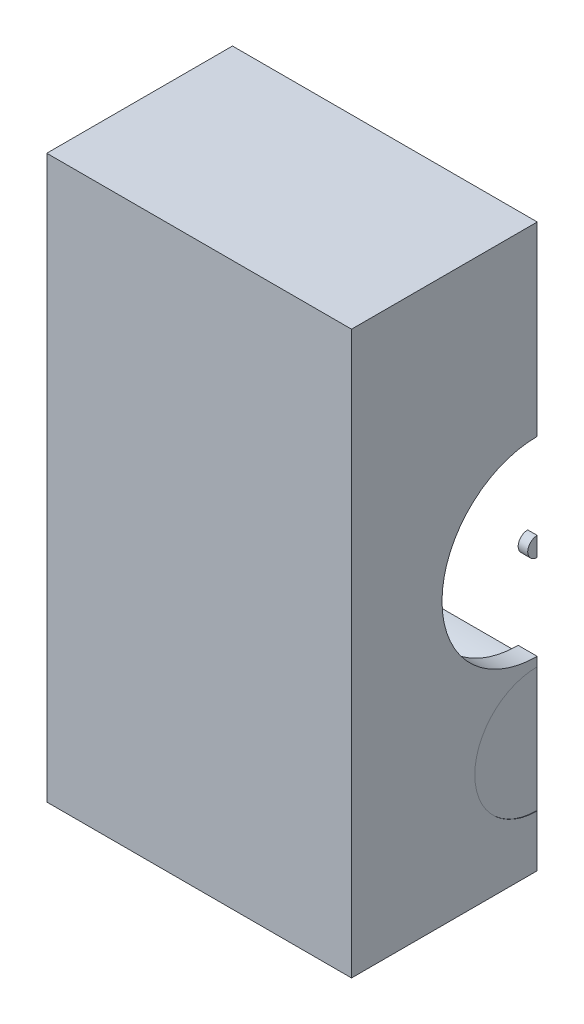
ISO-10303-21;
HEADER;
FILE_DESCRIPTION(('STEP AP214'),'2;1');
FILE_NAME('part.step','',(''),(''),'','','');
FILE_SCHEMA(('AUTOMOTIVE_DESIGN { 1 0 10303 214 1 1 1 1 }'));
ENDSEC;
DATA;
#1=APPLICATION_CONTEXT('core data for automotive mechanical design processes');
#2=APPLICATION_PROTOCOL_DEFINITION('international standard','automotive_design',2000,#1);
#3=PRODUCT_CONTEXT('',#1,'mechanical');
#4=PRODUCT('Part','Part','',(#3));
#5=PRODUCT_RELATED_PRODUCT_CATEGORY('part','',(#4));
#6=PRODUCT_DEFINITION_FORMATION('','',#4);
#7=PRODUCT_DEFINITION_CONTEXT('part definition',#1,'design');
#8=PRODUCT_DEFINITION('design','',#6,#7);
#9=PRODUCT_DEFINITION_SHAPE('','',#8);
#10=(LENGTH_UNIT() NAMED_UNIT(*) SI_UNIT(.MILLI.,.METRE.));
#11=(NAMED_UNIT(*) PLANE_ANGLE_UNIT() SI_UNIT($,.RADIAN.));
#12=(NAMED_UNIT(*) SI_UNIT($,.STERADIAN.) SOLID_ANGLE_UNIT());
#13=UNCERTAINTY_MEASURE_WITH_UNIT(LENGTH_MEASURE(1.E-05),#10,'distance_accuracy_value','');
#14=(GEOMETRIC_REPRESENTATION_CONTEXT(3) GLOBAL_UNCERTAINTY_ASSIGNED_CONTEXT((#13)) GLOBAL_UNIT_ASSIGNED_CONTEXT((#10,
#11,#12)) REPRESENTATION_CONTEXT('',''));
#15=CARTESIAN_POINT('',(0.,0.,0.));
#16=DIRECTION('',(0.,0.,1.));
#17=DIRECTION('',(1.,0.,0.));
#18=AXIS2_PLACEMENT_3D('',#15,#16,#17);
#19=CARTESIAN_POINT('',(290.,275.,195.));
#20=DIRECTION('',(1.,0.,0.));
#21=DIRECTION('',(0.,0.,-1.));
#22=AXIS2_PLACEMENT_3D('',#19,#20,#21);
#23=CYLINDRICAL_SURFACE('',#22,10.);
#24=DIRECTION('',(1.,0.,0.));
#25=VECTOR('',#24,1.);
#26=CARTESIAN_POINT('',(290.,265.,195.));
#27=LINE('',#26,#25);
#28=CARTESIAN_POINT('',(300.,265.,195.));
#29=VERTEX_POINT('',#28);
#30=CARTESIAN_POINT('',(290.,265.,195.));
#31=VERTEX_POINT('',#30);
#32=EDGE_CURVE('E61',#29,#31,#27,.F.);
#33=ORIENTED_EDGE('',*,*,#32,.F.);
#34=CARTESIAN_POINT('',(300.,275.,195.));
#35=DIRECTION('',(1.,0.,0.));
#36=DIRECTION('',(0.,0.,-1.));
#37=AXIS2_PLACEMENT_3D('',#34,#35,#36);
#38=CIRCLE('',#37,10.);
#39=CARTESIAN_POINT('',(300.,285.,195.));
#40=VERTEX_POINT('',#39);
#41=EDGE_CURVE('E72',#40,#29,#38,.T.);
#42=ORIENTED_EDGE('',*,*,#41,.F.);
#43=DIRECTION('',(1.,0.,0.));
#44=VECTOR('',#43,1.);
#45=CARTESIAN_POINT('',(290.,285.,195.));
#46=LINE('',#45,#44);
#47=CARTESIAN_POINT('',(290.,285.,195.));
#48=VERTEX_POINT('',#47);
#49=EDGE_CURVE('E56',#48,#40,#46,.T.);
#50=ORIENTED_EDGE('',*,*,#49,.F.);
#51=CARTESIAN_POINT('',(290.,275.,195.));
#52=DIRECTION('',(1.,0.,0.));
#53=DIRECTION('',(0.,0.,-1.));
#54=AXIS2_PLACEMENT_3D('',#51,#52,#53);
#55=CIRCLE('',#54,10.);
#56=EDGE_CURVE('E50',#48,#31,#55,.T.);
#57=ORIENTED_EDGE('',*,*,#56,.T.);
#58=EDGE_LOOP('',(#33,#42,#50,#57));
#59=FACE_BOUND('',#58,.T.);
#60=ADVANCED_FACE('F43',(#59),#23,.T.);
#61=CARTESIAN_POINT('',(290.,275.,195.));
#62=DIRECTION('',(1.,0.,0.));
#63=DIRECTION('',(0.,0.,-1.));
#64=AXIS2_PLACEMENT_3D('',#61,#62,#63);
#65=PLANE('',#64);
#66=ORIENTED_EDGE('',*,*,#56,.F.);
#67=DIRECTION('',(0.,-1.,0.));
#68=VECTOR('',#67,1.);
#69=CARTESIAN_POINT('',(290.,275.,195.));
#70=LINE('',#69,#68);
#71=EDGE_CURVE('E79',#48,#31,#70,.T.);
#72=ORIENTED_EDGE('',*,*,#71,.T.);
#73=EDGE_LOOP('',(#66,#72));
#74=FACE_BOUND('',#73,.T.);
#75=ADVANCED_FACE('F81',(#74),#65,.F.);
#76=CARTESIAN_POINT('',(300.,275.,195.));
#77=DIRECTION('',(1.,0.,0.));
#78=DIRECTION('',(0.,0.,-1.));
#79=AXIS2_PLACEMENT_3D('',#76,#77,#78);
#80=PLANE('',#79);
#81=DIRECTION('',(0.,-1.,0.));
#82=VECTOR('',#81,1.);
#83=CARTESIAN_POINT('',(300.,275.,195.));
#84=LINE('',#83,#82);
#85=EDGE_CURVE('E12',#40,#29,#84,.T.);
#86=ORIENTED_EDGE('',*,*,#85,.F.);
#87=ORIENTED_EDGE('',*,*,#41,.T.);
#88=EDGE_LOOP('',(#86,#87));
#89=FACE_BOUND('',#88,.T.);
#90=ADVANCED_FACE('F75',(#89),#80,.T.);
#91=CARTESIAN_POINT('',(-20.,570.,195.));
#92=DIRECTION('',(0.,0.,1.));
#93=DIRECTION('',(1.,0.,0.));
#94=AXIS2_PLACEMENT_3D('',#91,#92,#93);
#95=PLANE('',#94);
#96=ORIENTED_EDGE('',*,*,#32,.T.);
#97=ORIENTED_EDGE('',*,*,#71,.F.);
#98=ORIENTED_EDGE('',*,*,#49,.T.);
#99=ORIENTED_EDGE('',*,*,#85,.T.);
#100=EDGE_LOOP('',(#96,#97,#98,#99));
#101=FACE_BOUND('',#100,.T.);
#102=ADVANCED_FACE('F66',(#101),#95,.F.);
#103=CLOSED_SHELL('',(#60,#75,#90,#102));
#104=MANIFOLD_SOLID_BREP('B2',#103);
#105=CARTESIAN_POINT('',(141.5,100.,195.));
#106=DIRECTION('',(-1.,0.,0.));
#107=DIRECTION('',(0.,0.,1.));
#108=AXIS2_PLACEMENT_3D('',#105,#106,#107);
#109=PLANE('',#108);
#110=CARTESIAN_POINT('',(141.5,100.,195.));
#111=DIRECTION('',(-1.,0.,0.));
#112=DIRECTION('',(0.,0.,1.));
#113=AXIS2_PLACEMENT_3D('',#110,#111,#112);
#114=CIRCLE('',#113,65.55);
#115=CARTESIAN_POINT('',(141.5,165.55,195.));
#116=VERTEX_POINT('',#115);
#117=CARTESIAN_POINT('',(141.5,34.45,195.));
#118=VERTEX_POINT('',#117);
#119=EDGE_CURVE('E267',#116,#118,#114,.F.);
#120=ORIENTED_EDGE('',*,*,#119,.T.);
#121=DIRECTION('',(0.,1.,0.));
#122=VECTOR('',#121,1.);
#123=CARTESIAN_POINT('',(141.5,100.,195.));
#124=LINE('',#123,#122);
#125=EDGE_CURVE('E281',#118,#116,#124,.T.);
#126=ORIENTED_EDGE('',*,*,#125,.T.);
#127=EDGE_LOOP('',(#120,#126));
#128=FACE_BOUND('',#127,.T.);
#129=ADVANCED_FACE('F115',(#128),#109,.F.);
#130=CARTESIAN_POINT('',(298.5,100.,195.));
#131=DIRECTION('',(1.,0.,0.));
#132=DIRECTION('',(0.,0.,-1.));
#133=AXIS2_PLACEMENT_3D('',#130,#131,#132);
#134=PLANE('',#133);
#135=CARTESIAN_POINT('',(298.5,100.,195.));
#136=DIRECTION('',(1.,0.,0.));
#137=DIRECTION('',(0.,0.,-1.));
#138=AXIS2_PLACEMENT_3D('',#135,#136,#137);
#139=CIRCLE('',#138,65.55);
#140=CARTESIAN_POINT('',(298.5,34.45,195.));
#141=VERTEX_POINT('',#140);
#142=CARTESIAN_POINT('',(298.5,165.55,195.));
#143=VERTEX_POINT('',#142);
#144=EDGE_CURVE('E263',#141,#143,#139,.F.);
#145=ORIENTED_EDGE('',*,*,#144,.T.);
#146=DIRECTION('',(0.,-1.,0.));
#147=VECTOR('',#146,1.);
#148=CARTESIAN_POINT('',(298.5,100.,195.));
#149=LINE('',#148,#147);
#150=EDGE_CURVE('E138',#143,#141,#149,.T.);
#151=ORIENTED_EDGE('',*,*,#150,.T.);
#152=EDGE_LOOP('',(#145,#151));
#153=FACE_BOUND('',#152,.T.);
#154=ADVANCED_FACE('F280',(#153),#134,.F.);
#155=CARTESIAN_POINT('',(280.,100.,195.));
#156=DIRECTION('',(1.,0.,0.));
#157=DIRECTION('',(0.,0.,-1.));
#158=AXIS2_PLACEMENT_3D('',#155,#156,#157);
#159=CYLINDRICAL_SURFACE('',#158,65.55);
#160=ORIENTED_EDGE('',*,*,#144,.F.);
#161=DIRECTION('',(1.,0.,0.));
#162=VECTOR('',#161,1.);
#163=CARTESIAN_POINT('',(280.,34.45,195.));
#164=LINE('',#163,#162);
#165=EDGE_CURVE('E41',#141,#118,#164,.F.);
#166=ORIENTED_EDGE('',*,*,#165,.T.);
#167=ORIENTED_EDGE('',*,*,#119,.F.);
#168=DIRECTION('',(1.,0.,0.));
#169=VECTOR('',#168,1.);
#170=CARTESIAN_POINT('',(280.,165.55,195.));
#171=LINE('',#170,#169);
#172=EDGE_CURVE('E123',#116,#143,#171,.T.);
#173=ORIENTED_EDGE('',*,*,#172,.T.);
#174=EDGE_LOOP('',(#160,#166,#167,#173));
#175=FACE_BOUND('',#174,.T.);
#176=ADVANCED_FACE('F277',(#175),#159,.F.);
#177=CARTESIAN_POINT('',(-20.,570.,195.));
#178=DIRECTION('',(0.,0.,1.));
#179=DIRECTION('',(1.,0.,0.));
#180=AXIS2_PLACEMENT_3D('',#177,#178,#179);
#181=PLANE('',#180);
#182=ORIENTED_EDGE('',*,*,#150,.F.);
#183=ORIENTED_EDGE('',*,*,#172,.F.);
#184=ORIENTED_EDGE('',*,*,#125,.F.);
#185=ORIENTED_EDGE('',*,*,#165,.F.);
#186=EDGE_LOOP('',(#182,#183,#184,#185));
#187=FACE_BOUND('',#186,.T.);
#188=DIRECTION('',(0.,-1.,0.));
#189=VECTOR('',#188,1.);
#190=CARTESIAN_POINT('',(300.,570.,195.));
#191=LINE('',#190,#189);
#192=CARTESIAN_POINT('',(300.,34.45,195.));
#193=VERTEX_POINT('',#192);
#194=CARTESIAN_POINT('',(300.,-20.,195.));
#195=VERTEX_POINT('',#194);
#196=EDGE_CURVE('E244',#193,#195,#191,.T.);
#197=ORIENTED_EDGE('',*,*,#196,.T.);
#198=DIRECTION('',(1.,0.,0.));
#199=VECTOR('',#198,1.);
#200=CARTESIAN_POINT('',(-20.,-20.,195.));
#201=LINE('',#200,#199);
#202=CARTESIAN_POINT('',(-20.,-20.,195.));
#203=VERTEX_POINT('',#202);
#204=EDGE_CURVE('E238',#203,#195,#201,.T.);
#205=ORIENTED_EDGE('',*,*,#204,.F.);
#206=DIRECTION('',(0.,-1.,0.));
#207=VECTOR('',#206,1.);
#208=CARTESIAN_POINT('',(-20.,570.,195.));
#209=LINE('',#208,#207);
#210=CARTESIAN_POINT('',(-20.,570.,195.));
#211=VERTEX_POINT('',#210);
#212=EDGE_CURVE('E241',#211,#203,#209,.T.);
#213=ORIENTED_EDGE('',*,*,#212,.F.);
#214=DIRECTION('',(1.,0.,0.));
#215=VECTOR('',#214,1.);
#216=CARTESIAN_POINT('',(-20.,570.,195.));
#217=LINE('',#216,#215);
#218=CARTESIAN_POINT('',(300.,570.,195.));
#219=VERTEX_POINT('',#218);
#220=EDGE_CURVE('E249',#211,#219,#217,.T.);
#221=ORIENTED_EDGE('',*,*,#220,.T.);
#222=CARTESIAN_POINT('',(300.,375.,195.));
#223=VERTEX_POINT('',#222);
#224=EDGE_CURVE('E258',#219,#223,#191,.T.);
#225=ORIENTED_EDGE('',*,*,#224,.T.);
#226=DIRECTION('',(1.,0.,0.));
#227=VECTOR('',#226,1.);
#228=CARTESIAN_POINT('',(280.,375.,195.));
#229=LINE('',#228,#227);
#230=CARTESIAN_POINT('',(280.,375.,195.));
#231=VERTEX_POINT('',#230);
#232=EDGE_CURVE('E314',#231,#223,#229,.T.);
#233=ORIENTED_EDGE('',*,*,#232,.F.);
#234=DIRECTION('',(0.,1.,0.));
#235=VECTOR('',#234,1.);
#236=CARTESIAN_POINT('',(280.,0.,195.));
#237=LINE('',#236,#235);
#238=CARTESIAN_POINT('',(280.,550.,195.));
#239=VERTEX_POINT('',#238);
#240=EDGE_CURVE('E304',#231,#239,#237,.T.);
#241=ORIENTED_EDGE('',*,*,#240,.T.);
#242=DIRECTION('',(-1.,0.,0.));
#243=VECTOR('',#242,1.);
#244=CARTESIAN_POINT('',(0.,550.,195.));
#245=LINE('',#244,#243);
#246=CARTESIAN_POINT('',(0.,550.,195.));
#247=VERTEX_POINT('',#246);
#248=EDGE_CURVE('E312',#239,#247,#245,.T.);
#249=ORIENTED_EDGE('',*,*,#248,.T.);
#250=DIRECTION('',(0.,-1.,0.));
#251=VECTOR('',#250,1.);
#252=CARTESIAN_POINT('',(0.,0.,195.));
#253=LINE('',#252,#251);
#254=CARTESIAN_POINT('',(0.,0.,195.));
#255=VERTEX_POINT('',#254);
#256=EDGE_CURVE('E310',#247,#255,#253,.T.);
#257=ORIENTED_EDGE('',*,*,#256,.T.);
#258=DIRECTION('',(1.,0.,0.));
#259=VECTOR('',#258,1.);
#260=CARTESIAN_POINT('',(0.,0.,195.));
#261=LINE('',#260,#259);
#262=CARTESIAN_POINT('',(280.,0.,195.));
#263=VERTEX_POINT('',#262);
#264=EDGE_CURVE('E305',#255,#263,#261,.T.);
#265=ORIENTED_EDGE('',*,*,#264,.T.);
#266=CARTESIAN_POINT('',(280.,31.45,195.));
#267=VERTEX_POINT('',#266);
#268=EDGE_CURVE('E303',#263,#267,#237,.T.);
#269=ORIENTED_EDGE('',*,*,#268,.T.);
#270=DIRECTION('',(1.,0.,0.));
#271=VECTOR('',#270,1.);
#272=CARTESIAN_POINT('',(140.,31.45,195.));
#273=LINE('',#272,#271);
#274=CARTESIAN_POINT('',(140.,31.45,195.));
#275=VERTEX_POINT('',#274);
#276=EDGE_CURVE('E298',#275,#267,#273,.T.);
#277=ORIENTED_EDGE('',*,*,#276,.F.);
#278=DIRECTION('',(0.,1.,0.));
#279=VECTOR('',#278,1.);
#280=CARTESIAN_POINT('',(140.,100.,195.));
#281=LINE('',#280,#279);
#282=CARTESIAN_POINT('',(140.,34.45,195.));
#283=VERTEX_POINT('',#282);
#284=EDGE_CURVE('E294',#275,#283,#281,.T.);
#285=ORIENTED_EDGE('',*,*,#284,.T.);
#286=DIRECTION('',(1.,0.,0.));
#287=VECTOR('',#286,1.);
#288=CARTESIAN_POINT('',(280.,34.45,195.));
#289=LINE('',#288,#287);
#290=CARTESIAN_POINT('',(140.5,34.45,195.));
#291=VERTEX_POINT('',#290);
#292=EDGE_CURVE('E130',#291,#283,#289,.F.);
#293=ORIENTED_EDGE('',*,*,#292,.F.);
#294=DIRECTION('',(0.,1.,0.));
#295=VECTOR('',#294,1.);
#296=CARTESIAN_POINT('',(140.5,100.,195.));
#297=LINE('',#296,#295);
#298=CARTESIAN_POINT('',(140.5,165.55,195.));
#299=VERTEX_POINT('',#298);
#300=EDGE_CURVE('E283',#291,#299,#297,.T.);
#301=ORIENTED_EDGE('',*,*,#300,.T.);
#302=DIRECTION('',(1.,0.,0.));
#303=VECTOR('',#302,1.);
#304=CARTESIAN_POINT('',(280.,165.55,195.));
#305=LINE('',#304,#303);
#306=CARTESIAN_POINT('',(140.,165.55,195.));
#307=VERTEX_POINT('',#306);
#308=EDGE_CURVE('E288',#307,#299,#305,.T.);
#309=ORIENTED_EDGE('',*,*,#308,.F.);
#310=CARTESIAN_POINT('',(140.,168.55,195.));
#311=VERTEX_POINT('',#310);
#312=EDGE_CURVE('E292',#307,#311,#281,.T.);
#313=ORIENTED_EDGE('',*,*,#312,.T.);
#314=DIRECTION('',(1.,0.,0.));
#315=VECTOR('',#314,1.);
#316=CARTESIAN_POINT('',(140.,168.55,195.));
#317=LINE('',#316,#315);
#318=CARTESIAN_POINT('',(280.,168.55,195.));
#319=VERTEX_POINT('',#318);
#320=EDGE_CURVE('E295',#319,#311,#317,.F.);
#321=ORIENTED_EDGE('',*,*,#320,.F.);
#322=CARTESIAN_POINT('',(280.,175.,195.));
#323=VERTEX_POINT('',#322);
#324=EDGE_CURVE('E301',#319,#323,#237,.T.);
#325=ORIENTED_EDGE('',*,*,#324,.T.);
#326=DIRECTION('',(1.,0.,0.));
#327=VECTOR('',#326,1.);
#328=CARTESIAN_POINT('',(280.,175.,195.));
#329=LINE('',#328,#327);
#330=CARTESIAN_POINT('',(300.,175.,195.));
#331=VERTEX_POINT('',#330);
#332=EDGE_CURVE('E307',#331,#323,#329,.F.);
#333=ORIENTED_EDGE('',*,*,#332,.F.);
#334=CARTESIAN_POINT('',(300.,165.55,195.));
#335=VERTEX_POINT('',#334);
#336=EDGE_CURVE('E391',#331,#335,#191,.T.);
#337=ORIENTED_EDGE('',*,*,#336,.T.);
#338=DIRECTION('',(1.,0.,0.));
#339=VECTOR('',#338,1.);
#340=CARTESIAN_POINT('',(280.,165.55,195.));
#341=LINE('',#340,#339);
#342=CARTESIAN_POINT('',(299.5,165.55,195.));
#343=VERTEX_POINT('',#342);
#344=EDGE_CURVE('E319',#343,#335,#341,.T.);
#345=ORIENTED_EDGE('',*,*,#344,.F.);
#346=DIRECTION('',(0.,-1.,0.));
#347=VECTOR('',#346,1.);
#348=CARTESIAN_POINT('',(299.5,100.,195.));
#349=LINE('',#348,#347);
#350=CARTESIAN_POINT('',(299.5,34.45,195.));
#351=VERTEX_POINT('',#350);
#352=EDGE_CURVE('E317',#343,#351,#349,.T.);
#353=ORIENTED_EDGE('',*,*,#352,.T.);
#354=DIRECTION('',(1.,0.,0.));
#355=VECTOR('',#354,1.);
#356=CARTESIAN_POINT('',(280.,34.45,195.));
#357=LINE('',#356,#355);
#358=EDGE_CURVE('E322',#193,#351,#357,.F.);
#359=ORIENTED_EDGE('',*,*,#358,.F.);
#360=EDGE_LOOP('',(#197,#205,#213,#221,#225,#233,#241,#249,#257,#265,#269,#277,#285,#293,#301,
#309,#313,#321,#325,#333,#337,#345,#353,#359));
#361=FACE_BOUND('',#360,.T.);
#362=ADVANCED_FACE('F240',(#187,#361),#181,.F.);
#363=CARTESIAN_POINT('',(140.5,100.,195.));
#364=DIRECTION('',(-1.,0.,0.));
#365=DIRECTION('',(0.,0.,1.));
#366=AXIS2_PLACEMENT_3D('',#363,#364,#365);
#367=CIRCLE('',#366,65.55);
#368=EDGE_CURVE('E325',#291,#299,#367,.T.);
#369=ORIENTED_EDGE('',*,*,#368,.F.);
#370=ORIENTED_EDGE('',*,*,#292,.T.);
#371=CARTESIAN_POINT('',(140.,100.,195.));
#372=DIRECTION('',(-1.,0.,0.));
#373=DIRECTION('',(0.,0.,1.));
#374=AXIS2_PLACEMENT_3D('',#371,#372,#373);
#375=CIRCLE('',#374,65.55);
#376=EDGE_CURVE('E331',#283,#307,#375,.T.);
#377=ORIENTED_EDGE('',*,*,#376,.T.);
#378=ORIENTED_EDGE('',*,*,#308,.T.);
#379=EDGE_LOOP('',(#369,#370,#377,#378));
#380=FACE_BOUND('',#379,.T.);
#381=ADVANCED_FACE('F423',(#380),#159,.F.);
#382=CARTESIAN_POINT('',(280.,0.,390.));
#383=DIRECTION('',(-1.,0.,0.));
#384=DIRECTION('',(0.,0.,1.));
#385=AXIS2_PLACEMENT_3D('',#382,#383,#384);
#386=PLANE('',#385);
#387=ORIENTED_EDGE('',*,*,#268,.F.);
#388=DIRECTION('',(0.,0.,-1.));
#389=VECTOR('',#388,1.);
#390=CARTESIAN_POINT('',(280.,0.,390.));
#391=LINE('',#390,#389);
#392=CARTESIAN_POINT('',(280.,0.,370.));
#393=VERTEX_POINT('',#392);
#394=EDGE_CURVE('E367',#393,#263,#391,.T.);
#395=ORIENTED_EDGE('',*,*,#394,.F.);
#396=DIRECTION('',(0.,1.,0.));
#397=VECTOR('',#396,1.);
#398=CARTESIAN_POINT('',(280.,550.,370.));
#399=LINE('',#398,#397);
#400=CARTESIAN_POINT('',(280.,550.,370.));
#401=VERTEX_POINT('',#400);
#402=EDGE_CURVE('E355',#393,#401,#399,.T.);
#403=ORIENTED_EDGE('',*,*,#402,.T.);
#404=DIRECTION('',(0.,0.,-1.));
#405=VECTOR('',#404,1.);
#406=CARTESIAN_POINT('',(280.,550.,390.));
#407=LINE('',#406,#405);
#408=EDGE_CURVE('E364',#401,#239,#407,.T.);
#409=ORIENTED_EDGE('',*,*,#408,.T.);
#410=ORIENTED_EDGE('',*,*,#240,.F.);
#411=CARTESIAN_POINT('',(280.,275.,195.));
#412=DIRECTION('',(1.,0.,0.));
#413=DIRECTION('',(0.,0.,-1.));
#414=AXIS2_PLACEMENT_3D('',#411,#412,#413);
#415=CIRCLE('',#414,100.);
#416=EDGE_CURVE('E344',#231,#323,#415,.T.);
#417=ORIENTED_EDGE('',*,*,#416,.T.);
#418=ORIENTED_EDGE('',*,*,#324,.F.);
#419=CARTESIAN_POINT('',(280.,100.,195.));
#420=DIRECTION('',(-1.,0.,0.));
#421=DIRECTION('',(0.,0.,1.));
#422=AXIS2_PLACEMENT_3D('',#419,#420,#421);
#423=CIRCLE('',#422,68.55);
#424=EDGE_CURVE('E334',#267,#319,#423,.T.);
#425=ORIENTED_EDGE('',*,*,#424,.F.);
#426=EDGE_LOOP('',(#387,#395,#403,#409,#410,#417,#418,#425));
#427=FACE_BOUND('',#426,.T.);
#428=ADVANCED_FACE('F428',(#427),#386,.T.);
#429=CARTESIAN_POINT('',(0.,0.,390.));
#430=DIRECTION('',(0.,0.,-1.));
#431=DIRECTION('',(-1.,0.,0.));
#432=AXIS2_PLACEMENT_3D('',#429,#430,#431);
#433=PLANE('',#432);
#434=DIRECTION('',(0.,-1.,0.));
#435=VECTOR('',#434,1.);
#436=CARTESIAN_POINT('',(-20.,-20.,390.));
#437=LINE('',#436,#435);
#438=CARTESIAN_POINT('',(-20.,570.,390.));
#439=VERTEX_POINT('',#438);
#440=CARTESIAN_POINT('',(-20.,-20.,390.));
#441=VERTEX_POINT('',#440);
#442=EDGE_CURVE('E373',#439,#441,#437,.T.);
#443=ORIENTED_EDGE('',*,*,#442,.T.);
#444=DIRECTION('',(1.,0.,0.));
#445=VECTOR('',#444,1.);
#446=CARTESIAN_POINT('',(-20.,-20.,390.));
#447=LINE('',#446,#445);
#448=CARTESIAN_POINT('',(300.,-20.,390.));
#449=VERTEX_POINT('',#448);
#450=EDGE_CURVE('E261',#441,#449,#447,.T.);
#451=ORIENTED_EDGE('',*,*,#450,.T.);
#452=DIRECTION('',(0.,1.,0.));
#453=VECTOR('',#452,1.);
#454=CARTESIAN_POINT('',(300.,-20.,390.));
#455=LINE('',#454,#453);
#456=CARTESIAN_POINT('',(300.,570.,390.));
#457=VERTEX_POINT('',#456);
#458=EDGE_CURVE('E376',#449,#457,#455,.T.);
#459=ORIENTED_EDGE('',*,*,#458,.T.);
#460=DIRECTION('',(-1.,0.,0.));
#461=VECTOR('',#460,1.);
#462=CARTESIAN_POINT('',(-20.,570.,390.));
#463=LINE('',#462,#461);
#464=EDGE_CURVE('E378',#457,#439,#463,.T.);
#465=ORIENTED_EDGE('',*,*,#464,.T.);
#466=EDGE_LOOP('',(#443,#451,#459,#465));
#467=FACE_BOUND('',#466,.T.);
#468=ADVANCED_FACE('F453',(#467),#433,.F.);
#469=CARTESIAN_POINT('',(-20.,-20.,390.));
#470=DIRECTION('',(1.,0.,0.));
#471=DIRECTION('',(0.,0.,-1.));
#472=AXIS2_PLACEMENT_3D('',#469,#470,#471);
#473=PLANE('',#472);
#474=DIRECTION('',(0.,0.,-1.));
#475=VECTOR('',#474,1.);
#476=CARTESIAN_POINT('',(-20.,570.,390.));
#477=LINE('',#476,#475);
#478=EDGE_CURVE('E257',#439,#211,#477,.T.);
#479=ORIENTED_EDGE('',*,*,#478,.T.);
#480=ORIENTED_EDGE('',*,*,#212,.T.);
#481=DIRECTION('',(0.,0.,-1.));
#482=VECTOR('',#481,1.);
#483=CARTESIAN_POINT('',(-20.,-20.,390.));
#484=LINE('',#483,#482);
#485=EDGE_CURVE('E255',#441,#203,#484,.T.);
#486=ORIENTED_EDGE('',*,*,#485,.F.);
#487=ORIENTED_EDGE('',*,*,#442,.F.);
#488=EDGE_LOOP('',(#479,#480,#486,#487));
#489=FACE_BOUND('',#488,.T.);
#490=ADVANCED_FACE('F117',(#489),#473,.F.);
#491=CARTESIAN_POINT('',(-20.,-20.,390.));
#492=DIRECTION('',(0.,1.,0.));
#493=DIRECTION('',(0.,0.,1.));
#494=AXIS2_PLACEMENT_3D('',#491,#492,#493);
#495=PLANE('',#494);
#496=ORIENTED_EDGE('',*,*,#485,.T.);
#497=ORIENTED_EDGE('',*,*,#204,.T.);
#498=DIRECTION('',(0.,0.,-1.));
#499=VECTOR('',#498,1.);
#500=CARTESIAN_POINT('',(300.,-20.,390.));
#501=LINE('',#500,#499);
#502=EDGE_CURVE('E264',#449,#195,#501,.T.);
#503=ORIENTED_EDGE('',*,*,#502,.F.);
#504=ORIENTED_EDGE('',*,*,#450,.F.);
#505=EDGE_LOOP('',(#496,#497,#503,#504));
#506=FACE_BOUND('',#505,.T.);
#507=ADVANCED_FACE('F260',(#506),#495,.F.);
#508=CARTESIAN_POINT('',(300.,-20.,390.));
#509=DIRECTION('',(-1.,0.,0.));
#510=DIRECTION('',(0.,0.,1.));
#511=AXIS2_PLACEMENT_3D('',#508,#509,#510);
#512=PLANE('',#511);
#513=ORIENTED_EDGE('',*,*,#502,.T.);
#514=ORIENTED_EDGE('',*,*,#196,.F.);
#515=CARTESIAN_POINT('',(300.,100.,195.));
#516=DIRECTION('',(1.,0.,0.));
#517=DIRECTION('',(0.,0.,-1.));
#518=AXIS2_PLACEMENT_3D('',#515,#516,#517);
#519=CIRCLE('',#518,65.55);
#520=EDGE_CURVE('E338',#335,#193,#519,.T.);
#521=ORIENTED_EDGE('',*,*,#520,.F.);
#522=ORIENTED_EDGE('',*,*,#336,.F.);
#523=CARTESIAN_POINT('',(300.,275.,195.));
#524=DIRECTION('',(1.,0.,0.));
#525=DIRECTION('',(0.,0.,-1.));
#526=AXIS2_PLACEMENT_3D('',#523,#524,#525);
#527=CIRCLE('',#526,100.);
#528=EDGE_CURVE('E343',#223,#331,#527,.T.);
#529=ORIENTED_EDGE('',*,*,#528,.F.);
#530=ORIENTED_EDGE('',*,*,#224,.F.);
#531=DIRECTION('',(0.,0.,-1.));
#532=VECTOR('',#531,1.);
#533=CARTESIAN_POINT('',(300.,570.,390.));
#534=LINE('',#533,#532);
#535=EDGE_CURVE('E269',#457,#219,#534,.T.);
#536=ORIENTED_EDGE('',*,*,#535,.F.);
#537=ORIENTED_EDGE('',*,*,#458,.F.);
#538=EDGE_LOOP('',(#513,#514,#521,#522,#529,#530,#536,#537));
#539=FACE_BOUND('',#538,.T.);
#540=ADVANCED_FACE('F388',(#539),#512,.F.);
#541=CARTESIAN_POINT('',(-20.,570.,390.));
#542=DIRECTION('',(0.,-1.,0.));
#543=DIRECTION('',(0.,0.,-1.));
#544=AXIS2_PLACEMENT_3D('',#541,#542,#543);
#545=PLANE('',#544);
#546=ORIENTED_EDGE('',*,*,#535,.T.);
#547=ORIENTED_EDGE('',*,*,#220,.F.);
#548=ORIENTED_EDGE('',*,*,#478,.F.);
#549=ORIENTED_EDGE('',*,*,#464,.F.);
#550=EDGE_LOOP('',(#546,#547,#548,#549));
#551=FACE_BOUND('',#550,.T.);
#552=ADVANCED_FACE('F384',(#551),#545,.F.);
#553=CARTESIAN_POINT('',(280.,275.,195.));
#554=DIRECTION('',(1.,0.,0.));
#555=DIRECTION('',(0.,0.,-1.));
#556=AXIS2_PLACEMENT_3D('',#553,#554,#555);
#557=CYLINDRICAL_SURFACE('',#556,100.);
#558=ORIENTED_EDGE('',*,*,#528,.T.);
#559=ORIENTED_EDGE('',*,*,#332,.T.);
#560=ORIENTED_EDGE('',*,*,#416,.F.);
#561=ORIENTED_EDGE('',*,*,#232,.T.);
#562=EDGE_LOOP('',(#558,#559,#560,#561));
#563=FACE_BOUND('',#562,.T.);
#564=ADVANCED_FACE('F459',(#563),#557,.F.);
#565=CARTESIAN_POINT('',(0.,0.,370.));
#566=DIRECTION('',(0.,0.,1.));
#567=DIRECTION('',(1.,0.,0.));
#568=AXIS2_PLACEMENT_3D('',#565,#566,#567);
#569=PLANE('',#568);
#570=DIRECTION('',(0.,-1.,0.));
#571=VECTOR('',#570,1.);
#572=CARTESIAN_POINT('',(0.,550.,370.));
#573=LINE('',#572,#571);
#574=CARTESIAN_POINT('',(0.,550.,370.));
#575=VERTEX_POINT('',#574);
#576=CARTESIAN_POINT('',(0.,0.,370.));
#577=VERTEX_POINT('',#576);
#578=EDGE_CURVE('E347',#575,#577,#573,.T.);
#579=ORIENTED_EDGE('',*,*,#578,.F.);
#580=DIRECTION('',(-1.,0.,0.));
#581=VECTOR('',#580,1.);
#582=CARTESIAN_POINT('',(0.,550.,370.));
#583=LINE('',#582,#581);
#584=EDGE_CURVE('E358',#401,#575,#583,.T.);
#585=ORIENTED_EDGE('',*,*,#584,.F.);
#586=ORIENTED_EDGE('',*,*,#402,.F.);
#587=DIRECTION('',(1.,0.,0.));
#588=VECTOR('',#587,1.);
#589=CARTESIAN_POINT('',(0.,0.,370.));
#590=LINE('',#589,#588);
#591=EDGE_CURVE('E352',#577,#393,#590,.T.);
#592=ORIENTED_EDGE('',*,*,#591,.F.);
#593=EDGE_LOOP('',(#579,#585,#586,#592));
#594=FACE_BOUND('',#593,.T.);
#595=ADVANCED_FACE('F508',(#594),#569,.F.);
#596=CARTESIAN_POINT('',(0.,550.,390.));
#597=DIRECTION('',(0.,-1.,0.));
#598=DIRECTION('',(0.,0.,-1.));
#599=AXIS2_PLACEMENT_3D('',#596,#597,#598);
#600=PLANE('',#599);
#601=ORIENTED_EDGE('',*,*,#248,.F.);
#602=ORIENTED_EDGE('',*,*,#408,.F.);
#603=ORIENTED_EDGE('',*,*,#584,.T.);
#604=DIRECTION('',(0.,0.,-1.));
#605=VECTOR('',#604,1.);
#606=CARTESIAN_POINT('',(0.,550.,390.));
#607=LINE('',#606,#605);
#608=EDGE_CURVE('E361',#575,#247,#607,.T.);
#609=ORIENTED_EDGE('',*,*,#608,.T.);
#610=EDGE_LOOP('',(#601,#602,#603,#609));
#611=FACE_BOUND('',#610,.T.);
#612=ADVANCED_FACE('F447',(#611),#600,.T.);
#613=CARTESIAN_POINT('',(0.,0.,390.));
#614=DIRECTION('',(0.,1.,0.));
#615=DIRECTION('',(0.,0.,1.));
#616=AXIS2_PLACEMENT_3D('',#613,#614,#615);
#617=PLANE('',#616);
#618=ORIENTED_EDGE('',*,*,#264,.F.);
#619=DIRECTION('',(0.,0.,-1.));
#620=VECTOR('',#619,1.);
#621=CARTESIAN_POINT('',(0.,0.,390.));
#622=LINE('',#621,#620);
#623=EDGE_CURVE('E370',#577,#255,#622,.T.);
#624=ORIENTED_EDGE('',*,*,#623,.F.);
#625=ORIENTED_EDGE('',*,*,#591,.T.);
#626=ORIENTED_EDGE('',*,*,#394,.T.);
#627=EDGE_LOOP('',(#618,#624,#625,#626));
#628=FACE_BOUND('',#627,.T.);
#629=ADVANCED_FACE('F441',(#628),#617,.T.);
#630=CARTESIAN_POINT('',(0.,0.,390.));
#631=DIRECTION('',(1.,0.,0.));
#632=DIRECTION('',(0.,0.,-1.));
#633=AXIS2_PLACEMENT_3D('',#630,#631,#632);
#634=PLANE('',#633);
#635=ORIENTED_EDGE('',*,*,#256,.F.);
#636=ORIENTED_EDGE('',*,*,#608,.F.);
#637=ORIENTED_EDGE('',*,*,#578,.T.);
#638=ORIENTED_EDGE('',*,*,#623,.T.);
#639=EDGE_LOOP('',(#635,#636,#637,#638));
#640=FACE_BOUND('',#639,.T.);
#641=ADVANCED_FACE('F435',(#640),#634,.T.);
#642=ORIENTED_EDGE('',*,*,#520,.T.);
#643=ORIENTED_EDGE('',*,*,#358,.T.);
#644=CARTESIAN_POINT('',(299.5,100.,195.));
#645=DIRECTION('',(1.,0.,0.));
#646=DIRECTION('',(0.,0.,-1.));
#647=AXIS2_PLACEMENT_3D('',#644,#645,#646);
#648=CIRCLE('',#647,65.55);
#649=EDGE_CURVE('E328',#343,#351,#648,.T.);
#650=ORIENTED_EDGE('',*,*,#649,.F.);
#651=ORIENTED_EDGE('',*,*,#344,.T.);
#652=EDGE_LOOP('',(#642,#643,#650,#651));
#653=FACE_BOUND('',#652,.T.);
#654=ADVANCED_FACE('F397',(#653),#159,.F.);
#655=CARTESIAN_POINT('',(140.,100.,195.));
#656=DIRECTION('',(-1.,0.,0.));
#657=DIRECTION('',(0.,0.,1.));
#658=AXIS2_PLACEMENT_3D('',#655,#656,#657);
#659=PLANE('',#658);
#660=ORIENTED_EDGE('',*,*,#284,.F.);
#661=CARTESIAN_POINT('',(140.,100.,195.));
#662=DIRECTION('',(-1.,0.,0.));
#663=DIRECTION('',(0.,0.,1.));
#664=AXIS2_PLACEMENT_3D('',#661,#662,#663);
#665=CIRCLE('',#664,68.55);
#666=EDGE_CURVE('E335',#275,#311,#665,.T.);
#667=ORIENTED_EDGE('',*,*,#666,.T.);
#668=ORIENTED_EDGE('',*,*,#312,.F.);
#669=ORIENTED_EDGE('',*,*,#376,.F.);
#670=EDGE_LOOP('',(#660,#667,#668,#669));
#671=FACE_BOUND('',#670,.T.);
#672=ADVANCED_FACE('F410',(#671),#659,.T.);
#673=CARTESIAN_POINT('',(140.,100.,195.));
#674=DIRECTION('',(1.,0.,0.));
#675=DIRECTION('',(0.,0.,-1.));
#676=AXIS2_PLACEMENT_3D('',#673,#674,#675);
#677=CYLINDRICAL_SURFACE('',#676,68.55);
#678=ORIENTED_EDGE('',*,*,#666,.F.);
#679=ORIENTED_EDGE('',*,*,#276,.T.);
#680=ORIENTED_EDGE('',*,*,#424,.T.);
#681=ORIENTED_EDGE('',*,*,#320,.T.);
#682=EDGE_LOOP('',(#678,#679,#680,#681));
#683=FACE_BOUND('',#682,.T.);
#684=ADVANCED_FACE('F402',(#683),#677,.T.);
#685=CARTESIAN_POINT('',(299.5,100.,195.));
#686=DIRECTION('',(1.,0.,0.));
#687=DIRECTION('',(0.,0.,-1.));
#688=AXIS2_PLACEMENT_3D('',#685,#686,#687);
#689=PLANE('',#688);
#690=ORIENTED_EDGE('',*,*,#352,.F.);
#691=ORIENTED_EDGE('',*,*,#649,.T.);
#692=EDGE_LOOP('',(#690,#691));
#693=FACE_BOUND('',#692,.T.);
#694=ADVANCED_FACE('F399',(#693),#689,.T.);
#695=CARTESIAN_POINT('',(140.5,100.,195.));
#696=DIRECTION('',(-1.,0.,0.));
#697=DIRECTION('',(0.,0.,1.));
#698=AXIS2_PLACEMENT_3D('',#695,#696,#697);
#699=PLANE('',#698);
#700=ORIENTED_EDGE('',*,*,#300,.F.);
#701=ORIENTED_EDGE('',*,*,#368,.T.);
#702=EDGE_LOOP('',(#700,#701));
#703=FACE_BOUND('',#702,.T.);
#704=ADVANCED_FACE('F401',(#703),#699,.T.);
#705=CLOSED_SHELL('',(#129,#154,#176,#362,#381,#428,#468,#490,#507,#540,#552,#564,#595,#612,
#629,#641,#654,#672,#684,#694,#704));
#706=MANIFOLD_SOLID_BREP('B6',#705);
#707=ADVANCED_BREP_SHAPE_REPRESENTATION('',(#18,#104,#706),#14);
#708=SHAPE_DEFINITION_REPRESENTATION(#9,#707);
ENDSEC;
END-ISO-10303-21;
